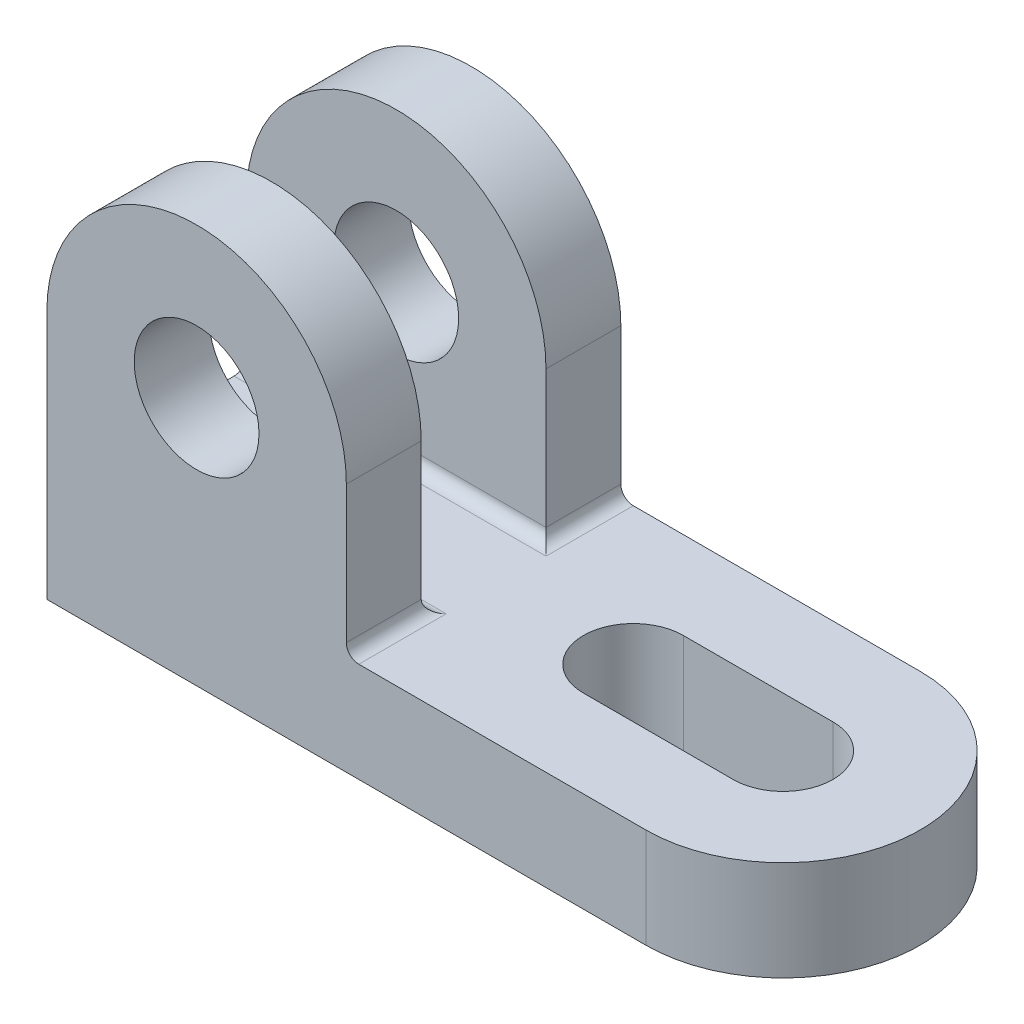
ISO-10303-21;
HEADER;
FILE_DESCRIPTION(('STEP AP214'),'2;1');
FILE_NAME('part.step','',(''),(''),'','','');
FILE_SCHEMA(('AUTOMOTIVE_DESIGN { 1 0 10303 214 1 1 1 1 }'));
ENDSEC;
DATA;
#1=APPLICATION_CONTEXT('core data for automotive mechanical design processes');
#2=APPLICATION_PROTOCOL_DEFINITION('international standard','automotive_design',2000,#1);
#3=PRODUCT_CONTEXT('',#1,'mechanical');
#4=PRODUCT('Part','Part','',(#3));
#5=PRODUCT_RELATED_PRODUCT_CATEGORY('part','',(#4));
#6=PRODUCT_DEFINITION_FORMATION('','',#4);
#7=PRODUCT_DEFINITION_CONTEXT('part definition',#1,'design');
#8=PRODUCT_DEFINITION('design','',#6,#7);
#9=PRODUCT_DEFINITION_SHAPE('','',#8);
#10=(LENGTH_UNIT() NAMED_UNIT(*) SI_UNIT(.MILLI.,.METRE.));
#11=(NAMED_UNIT(*) PLANE_ANGLE_UNIT() SI_UNIT($,.RADIAN.));
#12=(NAMED_UNIT(*) SI_UNIT($,.STERADIAN.) SOLID_ANGLE_UNIT());
#13=UNCERTAINTY_MEASURE_WITH_UNIT(LENGTH_MEASURE(1.E-05),#10,'distance_accuracy_value','');
#14=(GEOMETRIC_REPRESENTATION_CONTEXT(3) GLOBAL_UNCERTAINTY_ASSIGNED_CONTEXT((#13)) GLOBAL_UNIT_ASSIGNED_CONTEXT((#10,
#11,#12)) REPRESENTATION_CONTEXT('',''));
#15=CARTESIAN_POINT('',(0.,0.,0.));
#16=DIRECTION('',(0.,0.,1.));
#17=DIRECTION('',(1.,0.,0.));
#18=AXIS2_PLACEMENT_3D('',#15,#16,#17);
#19=CARTESIAN_POINT('',(0.,16.,0.));
#20=DIRECTION('',(0.,1.,0.));
#21=DIRECTION('',(0.,0.,1.));
#22=AXIS2_PLACEMENT_3D('',#19,#20,#21);
#23=PLANE('',#22);
#24=CARTESIAN_POINT('',(37.,16.,0.));
#25=DIRECTION('',(0.,1.,0.));
#26=DIRECTION('',(0.,0.,1.));
#27=AXIS2_PLACEMENT_3D('',#24,#25,#26);
#28=CIRCLE('',#27,8.00000000000003);
#29=CARTESIAN_POINT('',(37.,16.,8.00000000000003));
#30=VERTEX_POINT('',#29);
#31=CARTESIAN_POINT('',(37.,16.,-8.00000000000003));
#32=VERTEX_POINT('',#31);
#33=EDGE_CURVE('E209',#30,#32,#28,.T.);
#34=ORIENTED_EDGE('',*,*,#33,.F.);
#35=DIRECTION('',(1.,0.,0.));
#36=VECTOR('',#35,1.);
#37=CARTESIAN_POINT('',(37.,16.,8.00000000000003));
#38=LINE('',#37,#36);
#39=CARTESIAN_POINT('',(13.,16.,8.00000000000003));
#40=VERTEX_POINT('',#39);
#41=EDGE_CURVE('E216',#40,#30,#38,.T.);
#42=ORIENTED_EDGE('',*,*,#41,.F.);
#43=CARTESIAN_POINT('',(13.,16.,0.));
#44=DIRECTION('',(0.,1.,0.));
#45=DIRECTION('',(0.,0.,1.));
#46=AXIS2_PLACEMENT_3D('',#43,#44,#45);
#47=CIRCLE('',#46,8.00000000000003);
#48=CARTESIAN_POINT('',(13.,16.,-8.00000000000002));
#49=VERTEX_POINT('',#48);
#50=EDGE_CURVE('E230',#49,#40,#47,.T.);
#51=ORIENTED_EDGE('',*,*,#50,.F.);
#52=DIRECTION('',(-1.,0.,0.));
#53=VECTOR('',#52,1.);
#54=CARTESIAN_POINT('',(37.,16.,-8.00000000000003));
#55=LINE('',#54,#53);
#56=EDGE_CURVE('E227',#32,#49,#55,.T.);
#57=ORIENTED_EDGE('',*,*,#56,.F.);
#58=EDGE_LOOP('',(#34,#42,#51,#57));
#59=FACE_BOUND('',#58,.T.);
#60=DIRECTION('',(0.,0.,-1.));
#61=VECTOR('',#60,1.);
#62=CARTESIAN_POINT('',(-9.00000000000001,16.,0.));
#63=LINE('',#62,#61);
#64=CARTESIAN_POINT('',(-9.00000000000001,16.,-22.));
#65=VERTEX_POINT('',#64);
#66=CARTESIAN_POINT('',(-9.00000000000001,16.,-8.00000000000002));
#67=VERTEX_POINT('',#66);
#68=EDGE_CURVE('E278',#65,#67,#63,.F.);
#69=ORIENTED_EDGE('',*,*,#68,.T.);
#70=DIRECTION('',(-1.,0.,0.));
#71=VECTOR('',#70,1.);
#72=CARTESIAN_POINT('',(0.,16.,-8.00000000000002));
#73=LINE('',#72,#71);
#74=CARTESIAN_POINT('',(-59.,16.,-8.00000000000002));
#75=VERTEX_POINT('',#74);
#76=EDGE_CURVE('E280',#67,#75,#73,.T.);
#77=ORIENTED_EDGE('',*,*,#76,.T.);
#78=DIRECTION('',(0.,0.,1.));
#79=VECTOR('',#78,1.);
#80=CARTESIAN_POINT('',(-59.,16.,0.));
#81=LINE('',#80,#79);
#82=CARTESIAN_POINT('',(-59.,16.,8.00000000000002));
#83=VERTEX_POINT('',#82);
#84=EDGE_CURVE('E252',#75,#83,#81,.T.);
#85=ORIENTED_EDGE('',*,*,#84,.T.);
#86=DIRECTION('',(-1.,0.,0.));
#87=VECTOR('',#86,1.);
#88=CARTESIAN_POINT('',(0.,16.,8.00000000000002));
#89=LINE('',#88,#87);
#90=CARTESIAN_POINT('',(-9.00000000000001,16.,8.00000000000002));
#91=VERTEX_POINT('',#90);
#92=EDGE_CURVE('E276',#83,#91,#89,.F.);
#93=ORIENTED_EDGE('',*,*,#92,.T.);
#94=DIRECTION('',(0.,0.,1.));
#95=VECTOR('',#94,1.);
#96=CARTESIAN_POINT('',(-9.00000000000001,16.,22.));
#97=LINE('',#96,#95);
#98=CARTESIAN_POINT('',(-9.00000000000001,16.,22.));
#99=VERTEX_POINT('',#98);
#100=EDGE_CURVE('E274',#91,#99,#97,.T.);
#101=ORIENTED_EDGE('',*,*,#100,.T.);
#102=DIRECTION('',(1.,0.,0.));
#103=VECTOR('',#102,1.);
#104=CARTESIAN_POINT('',(0.,16.,22.));
#105=LINE('',#104,#103);
#106=CARTESIAN_POINT('',(37.,16.,22.));
#107=VERTEX_POINT('',#106);
#108=EDGE_CURVE('E244',#99,#107,#105,.T.);
#109=ORIENTED_EDGE('',*,*,#108,.T.);
#110=CARTESIAN_POINT('',(37.,16.,0.));
#111=DIRECTION('',(0.,1.,0.));
#112=DIRECTION('',(0.,0.,1.));
#113=AXIS2_PLACEMENT_3D('',#110,#111,#112);
#114=CIRCLE('',#113,22.);
#115=CARTESIAN_POINT('',(37.,16.,-22.));
#116=VERTEX_POINT('',#115);
#117=EDGE_CURVE('E246',#107,#116,#114,.T.);
#118=ORIENTED_EDGE('',*,*,#117,.T.);
#119=DIRECTION('',(1.,0.,0.));
#120=VECTOR('',#119,1.);
#121=CARTESIAN_POINT('',(0.,16.,-22.));
#122=LINE('',#121,#120);
#123=EDGE_CURVE('E250',#65,#116,#122,.T.);
#124=ORIENTED_EDGE('',*,*,#123,.F.);
#125=EDGE_LOOP('',(#69,#77,#85,#93,#101,#109,#118,#124));
#126=FACE_BOUND('',#125,.T.);
#127=ADVANCED_FACE('F39',(#59,#126),#23,.T.);
#128=CARTESIAN_POINT('',(0.,16.,22.));
#129=DIRECTION('',(0.,0.,-1.));
#130=DIRECTION('',(-1.,0.,0.));
#131=AXIS2_PLACEMENT_3D('',#128,#129,#130);
#132=PLANE('',#131);
#133=DIRECTION('',(1.,0.,0.));
#134=VECTOR('',#133,1.);
#135=CARTESIAN_POINT('',(0.,0.,22.));
#136=LINE('',#135,#134);
#137=CARTESIAN_POINT('',(-59.,0.,22.));
#138=VERTEX_POINT('',#137);
#139=CARTESIAN_POINT('',(37.,0.,22.));
#140=VERTEX_POINT('',#139);
#141=EDGE_CURVE('E237',#138,#140,#136,.T.);
#142=ORIENTED_EDGE('',*,*,#141,.T.);
#143=DIRECTION('',(0.,-1.,0.));
#144=VECTOR('',#143,1.);
#145=CARTESIAN_POINT('',(37.,16.,22.));
#146=LINE('',#145,#144);
#147=EDGE_CURVE('E271',#107,#140,#146,.T.);
#148=ORIENTED_EDGE('',*,*,#147,.F.);
#149=ORIENTED_EDGE('',*,*,#108,.F.);
#150=CARTESIAN_POINT('',(-9.00000000000001,18.,22.));
#151=DIRECTION('',(0.,0.,-1.));
#152=DIRECTION('',(-1.,0.,0.));
#153=AXIS2_PLACEMENT_3D('',#150,#151,#152);
#154=CIRCLE('',#153,2.);
#155=CARTESIAN_POINT('',(-11.,18.,22.));
#156=VERTEX_POINT('',#155);
#157=EDGE_CURVE('E11',#99,#156,#154,.T.);
#158=ORIENTED_EDGE('',*,*,#157,.T.);
#159=DIRECTION('',(0.,1.,0.));
#160=VECTOR('',#159,1.);
#161=CARTESIAN_POINT('',(-11.,0.,22.));
#162=LINE('',#161,#160);
#163=CARTESIAN_POINT('',(-11.,40.,22.));
#164=VERTEX_POINT('',#163);
#165=EDGE_CURVE('E202',#156,#164,#162,.T.);
#166=ORIENTED_EDGE('',*,*,#165,.T.);
#167=CARTESIAN_POINT('',(-35.,40.,22.));
#168=DIRECTION('',(0.,0.,1.));
#169=DIRECTION('',(1.,0.,0.));
#170=AXIS2_PLACEMENT_3D('',#167,#168,#169);
#171=CIRCLE('',#170,24.);
#172=CARTESIAN_POINT('',(-59.,40.,22.));
#173=VERTEX_POINT('',#172);
#174=EDGE_CURVE('E192',#164,#173,#171,.T.);
#175=ORIENTED_EDGE('',*,*,#174,.T.);
#176=DIRECTION('',(0.,-1.,0.));
#177=VECTOR('',#176,1.);
#178=CARTESIAN_POINT('',(-59.,16.,22.));
#179=LINE('',#178,#177);
#180=EDGE_CURVE('E255',#173,#138,#179,.T.);
#181=ORIENTED_EDGE('',*,*,#180,.T.);
#182=EDGE_LOOP('',(#142,#148,#149,#158,#166,#175,#181));
#183=FACE_BOUND('',#182,.T.);
#184=CARTESIAN_POINT('',(-35.,40.,22.));
#185=DIRECTION('',(0.,0.,1.));
#186=DIRECTION('',(1.,0.,0.));
#187=AXIS2_PLACEMENT_3D('',#184,#185,#186);
#188=CIRCLE('',#187,10.);
#189=CARTESIAN_POINT('',(-25.,40.,22.));
#190=VERTEX_POINT('',#189);
#191=EDGE_CURVE('E184',#190,#190,#188,.T.);
#192=ORIENTED_EDGE('',*,*,#191,.F.);
#193=EDGE_LOOP('',(#192));
#194=FACE_BOUND('',#193,.T.);
#195=ADVANCED_FACE('F315',(#183,#194),#132,.F.);
#196=CARTESIAN_POINT('',(37.,16.,0.));
#197=DIRECTION('',(0.,-1.,0.));
#198=DIRECTION('',(0.,0.,-1.));
#199=AXIS2_PLACEMENT_3D('',#196,#197,#198);
#200=CYLINDRICAL_SURFACE('',#199,22.);
#201=CARTESIAN_POINT('',(37.,0.,0.));
#202=DIRECTION('',(0.,1.,0.));
#203=DIRECTION('',(0.,0.,1.));
#204=AXIS2_PLACEMENT_3D('',#201,#202,#203);
#205=CIRCLE('',#204,22.);
#206=CARTESIAN_POINT('',(37.,0.,-22.));
#207=VERTEX_POINT('',#206);
#208=EDGE_CURVE('E258',#140,#207,#205,.T.);
#209=ORIENTED_EDGE('',*,*,#208,.T.);
#210=DIRECTION('',(0.,-1.,0.));
#211=VECTOR('',#210,1.);
#212=CARTESIAN_POINT('',(37.,16.,-22.));
#213=LINE('',#212,#211);
#214=EDGE_CURVE('E269',#116,#207,#213,.T.);
#215=ORIENTED_EDGE('',*,*,#214,.F.);
#216=ORIENTED_EDGE('',*,*,#117,.F.);
#217=ORIENTED_EDGE('',*,*,#147,.T.);
#218=EDGE_LOOP('',(#209,#215,#216,#217));
#219=FACE_BOUND('',#218,.T.);
#220=ADVANCED_FACE('F319',(#219),#200,.T.);
#221=CARTESIAN_POINT('',(0.,16.,-22.));
#222=DIRECTION('',(0.,0.,-1.));
#223=DIRECTION('',(-1.,0.,0.));
#224=AXIS2_PLACEMENT_3D('',#221,#222,#223);
#225=PLANE('',#224);
#226=DIRECTION('',(1.,0.,0.));
#227=VECTOR('',#226,1.);
#228=CARTESIAN_POINT('',(0.,0.,-22.));
#229=LINE('',#228,#227);
#230=CARTESIAN_POINT('',(-59.,0.,-22.));
#231=VERTEX_POINT('',#230);
#232=EDGE_CURVE('E261',#231,#207,#229,.T.);
#233=ORIENTED_EDGE('',*,*,#232,.F.);
#234=DIRECTION('',(0.,-1.,0.));
#235=VECTOR('',#234,1.);
#236=CARTESIAN_POINT('',(-59.,16.,-22.));
#237=LINE('',#236,#235);
#238=CARTESIAN_POINT('',(-59.,40.,-22.));
#239=VERTEX_POINT('',#238);
#240=EDGE_CURVE('E267',#239,#231,#237,.T.);
#241=ORIENTED_EDGE('',*,*,#240,.F.);
#242=CARTESIAN_POINT('',(-35.,40.,-22.));
#243=DIRECTION('',(0.,0.,1.));
#244=DIRECTION('',(1.,0.,0.));
#245=AXIS2_PLACEMENT_3D('',#242,#243,#244);
#246=CIRCLE('',#245,24.);
#247=CARTESIAN_POINT('',(-11.,40.,-22.));
#248=VERTEX_POINT('',#247);
#249=EDGE_CURVE('E181',#248,#239,#246,.T.);
#250=ORIENTED_EDGE('',*,*,#249,.F.);
#251=DIRECTION('',(0.,1.,0.));
#252=VECTOR('',#251,1.);
#253=CARTESIAN_POINT('',(-11.,0.,-22.));
#254=LINE('',#253,#252);
#255=CARTESIAN_POINT('',(-11.,18.,-22.));
#256=VERTEX_POINT('',#255);
#257=EDGE_CURVE('E301',#256,#248,#254,.T.);
#258=ORIENTED_EDGE('',*,*,#257,.F.);
#259=CARTESIAN_POINT('',(-9.00000000000001,18.,-22.));
#260=DIRECTION('',(0.,0.,-1.));
#261=DIRECTION('',(-1.,0.,0.));
#262=AXIS2_PLACEMENT_3D('',#259,#260,#261);
#263=CIRCLE('',#262,2.);
#264=EDGE_CURVE('E48',#256,#65,#263,.F.);
#265=ORIENTED_EDGE('',*,*,#264,.T.);
#266=ORIENTED_EDGE('',*,*,#123,.T.);
#267=ORIENTED_EDGE('',*,*,#214,.T.);
#268=EDGE_LOOP('',(#233,#241,#250,#258,#265,#266,#267));
#269=FACE_BOUND('',#268,.T.);
#270=CARTESIAN_POINT('',(-35.,40.,-22.));
#271=DIRECTION('',(0.,0.,1.));
#272=DIRECTION('',(1.,0.,0.));
#273=AXIS2_PLACEMENT_3D('',#270,#271,#272);
#274=CIRCLE('',#273,10.);
#275=CARTESIAN_POINT('',(-25.,40.,-22.));
#276=VERTEX_POINT('',#275);
#277=EDGE_CURVE('E296',#276,#276,#274,.T.);
#278=ORIENTED_EDGE('',*,*,#277,.T.);
#279=EDGE_LOOP('',(#278));
#280=FACE_BOUND('',#279,.T.);
#281=ADVANCED_FACE('F344',(#269,#280),#225,.T.);
#282=CARTESIAN_POINT('',(-59.,16.,0.));
#283=DIRECTION('',(1.,0.,0.));
#284=DIRECTION('',(0.,0.,-1.));
#285=AXIS2_PLACEMENT_3D('',#282,#283,#284);
#286=PLANE('',#285);
#287=DIRECTION('',(0.,0.,1.));
#288=VECTOR('',#287,1.);
#289=CARTESIAN_POINT('',(-59.,0.,0.));
#290=LINE('',#289,#288);
#291=EDGE_CURVE('E247',#231,#138,#290,.T.);
#292=ORIENTED_EDGE('',*,*,#291,.T.);
#293=ORIENTED_EDGE('',*,*,#180,.F.);
#294=DIRECTION('',(0.,0.,1.));
#295=VECTOR('',#294,1.);
#296=CARTESIAN_POINT('',(-59.,40.,10.));
#297=LINE('',#296,#295);
#298=CARTESIAN_POINT('',(-59.,40.,10.));
#299=VERTEX_POINT('',#298);
#300=EDGE_CURVE('E206',#299,#173,#297,.T.);
#301=ORIENTED_EDGE('',*,*,#300,.F.);
#302=DIRECTION('',(0.,1.,0.));
#303=VECTOR('',#302,1.);
#304=CARTESIAN_POINT('',(-59.,0.,10.));
#305=LINE('',#304,#303);
#306=CARTESIAN_POINT('',(-59.,18.,10.));
#307=VERTEX_POINT('',#306);
#308=EDGE_CURVE('E197',#307,#299,#305,.T.);
#309=ORIENTED_EDGE('',*,*,#308,.F.);
#310=CARTESIAN_POINT('',(-59.,18.,8.00000000000002));
#311=DIRECTION('',(1.,0.,0.));
#312=DIRECTION('',(0.,0.,-1.));
#313=AXIS2_PLACEMENT_3D('',#310,#311,#312);
#314=CIRCLE('',#313,2.);
#315=EDGE_CURVE('E292',#307,#83,#314,.T.);
#316=ORIENTED_EDGE('',*,*,#315,.T.);
#317=ORIENTED_EDGE('',*,*,#84,.F.);
#318=CARTESIAN_POINT('',(-59.,18.,-8.00000000000002));
#319=DIRECTION('',(1.,0.,0.));
#320=DIRECTION('',(0.,0.,-1.));
#321=AXIS2_PLACEMENT_3D('',#318,#319,#320);
#322=CIRCLE('',#321,2.);
#323=CARTESIAN_POINT('',(-59.,18.,-10.));
#324=VERTEX_POINT('',#323);
#325=EDGE_CURVE('E167',#75,#324,#322,.T.);
#326=ORIENTED_EDGE('',*,*,#325,.T.);
#327=DIRECTION('',(0.,1.,0.));
#328=VECTOR('',#327,1.);
#329=CARTESIAN_POINT('',(-59.,0.,-10.));
#330=LINE('',#329,#328);
#331=CARTESIAN_POINT('',(-59.,40.,-10.));
#332=VERTEX_POINT('',#331);
#333=EDGE_CURVE('E160',#324,#332,#330,.T.);
#334=ORIENTED_EDGE('',*,*,#333,.T.);
#335=DIRECTION('',(0.,0.,-1.));
#336=VECTOR('',#335,1.);
#337=CARTESIAN_POINT('',(-59.,40.,-10.));
#338=LINE('',#337,#336);
#339=EDGE_CURVE('E164',#332,#239,#338,.T.);
#340=ORIENTED_EDGE('',*,*,#339,.T.);
#341=ORIENTED_EDGE('',*,*,#240,.T.);
#342=EDGE_LOOP('',(#292,#293,#301,#309,#316,#317,#326,#334,#340,#341));
#343=FACE_BOUND('',#342,.T.);
#344=ADVANCED_FACE('F162',(#343),#286,.F.);
#345=CARTESIAN_POINT('',(0.,0.,0.));
#346=DIRECTION('',(0.,1.,0.));
#347=DIRECTION('',(0.,0.,1.));
#348=AXIS2_PLACEMENT_3D('',#345,#346,#347);
#349=PLANE('',#348);
#350=DIRECTION('',(1.,0.,0.));
#351=VECTOR('',#350,1.);
#352=CARTESIAN_POINT('',(37.,0.,8.00000000000003));
#353=LINE('',#352,#351);
#354=CARTESIAN_POINT('',(13.,0.,8.00000000000003));
#355=VERTEX_POINT('',#354);
#356=CARTESIAN_POINT('',(37.,0.,8.00000000000003));
#357=VERTEX_POINT('',#356);
#358=EDGE_CURVE('E222',#355,#357,#353,.T.);
#359=ORIENTED_EDGE('',*,*,#358,.T.);
#360=CARTESIAN_POINT('',(37.,0.,0.));
#361=DIRECTION('',(0.,1.,0.));
#362=DIRECTION('',(0.,0.,1.));
#363=AXIS2_PLACEMENT_3D('',#360,#361,#362);
#364=CIRCLE('',#363,8.00000000000003);
#365=CARTESIAN_POINT('',(37.,0.,-8.00000000000003));
#366=VERTEX_POINT('',#365);
#367=EDGE_CURVE('E212',#357,#366,#364,.T.);
#368=ORIENTED_EDGE('',*,*,#367,.T.);
#369=DIRECTION('',(-1.,0.,0.));
#370=VECTOR('',#369,1.);
#371=CARTESIAN_POINT('',(37.,0.,-8.00000000000003));
#372=LINE('',#371,#370);
#373=CARTESIAN_POINT('',(13.,0.,-8.00000000000002));
#374=VERTEX_POINT('',#373);
#375=EDGE_CURVE('E215',#366,#374,#372,.T.);
#376=ORIENTED_EDGE('',*,*,#375,.T.);
#377=CARTESIAN_POINT('',(13.,0.,0.));
#378=DIRECTION('',(0.,1.,0.));
#379=DIRECTION('',(0.,0.,1.));
#380=AXIS2_PLACEMENT_3D('',#377,#378,#379);
#381=CIRCLE('',#380,8.00000000000003);
#382=EDGE_CURVE('E219',#374,#355,#381,.T.);
#383=ORIENTED_EDGE('',*,*,#382,.T.);
#384=EDGE_LOOP('',(#359,#368,#376,#383));
#385=FACE_BOUND('',#384,.T.);
#386=ORIENTED_EDGE('',*,*,#141,.F.);
#387=ORIENTED_EDGE('',*,*,#291,.F.);
#388=ORIENTED_EDGE('',*,*,#232,.T.);
#389=ORIENTED_EDGE('',*,*,#208,.F.);
#390=EDGE_LOOP('',(#386,#387,#388,#389));
#391=FACE_BOUND('',#390,.T.);
#392=ADVANCED_FACE('F342',(#385,#391),#349,.F.);
#393=CARTESIAN_POINT('',(37.,0.,0.));
#394=DIRECTION('',(0.,1.,0.));
#395=DIRECTION('',(0.,0.,1.));
#396=AXIS2_PLACEMENT_3D('',#393,#394,#395);
#397=CYLINDRICAL_SURFACE('',#396,8.00000000000003);
#398=ORIENTED_EDGE('',*,*,#33,.T.);
#399=DIRECTION('',(0.,1.,0.));
#400=VECTOR('',#399,1.);
#401=CARTESIAN_POINT('',(37.,0.,-8.00000000000003));
#402=LINE('',#401,#400);
#403=EDGE_CURVE('E225',#366,#32,#402,.T.);
#404=ORIENTED_EDGE('',*,*,#403,.F.);
#405=ORIENTED_EDGE('',*,*,#367,.F.);
#406=DIRECTION('',(0.,1.,0.));
#407=VECTOR('',#406,1.);
#408=CARTESIAN_POINT('',(37.,0.,8.00000000000003));
#409=LINE('',#408,#407);
#410=EDGE_CURVE('E235',#357,#30,#409,.T.);
#411=ORIENTED_EDGE('',*,*,#410,.T.);
#412=EDGE_LOOP('',(#398,#404,#405,#411));
#413=FACE_BOUND('',#412,.T.);
#414=ADVANCED_FACE('F377',(#413),#397,.F.);
#415=CARTESIAN_POINT('',(37.,0.,8.00000000000003));
#416=DIRECTION('',(0.,0.,1.));
#417=DIRECTION('',(1.,0.,0.));
#418=AXIS2_PLACEMENT_3D('',#415,#416,#417);
#419=PLANE('',#418);
#420=ORIENTED_EDGE('',*,*,#41,.T.);
#421=ORIENTED_EDGE('',*,*,#410,.F.);
#422=ORIENTED_EDGE('',*,*,#358,.F.);
#423=DIRECTION('',(0.,1.,0.));
#424=VECTOR('',#423,1.);
#425=CARTESIAN_POINT('',(13.,0.,8.00000000000003));
#426=LINE('',#425,#424);
#427=EDGE_CURVE('E238',#355,#40,#426,.T.);
#428=ORIENTED_EDGE('',*,*,#427,.T.);
#429=EDGE_LOOP('',(#420,#421,#422,#428));
#430=FACE_BOUND('',#429,.T.);
#431=ADVANCED_FACE('F498',(#430),#419,.F.);
#432=CARTESIAN_POINT('',(13.,0.,0.));
#433=DIRECTION('',(0.,1.,0.));
#434=DIRECTION('',(0.,0.,1.));
#435=AXIS2_PLACEMENT_3D('',#432,#433,#434);
#436=CYLINDRICAL_SURFACE('',#435,8.00000000000003);
#437=ORIENTED_EDGE('',*,*,#50,.T.);
#438=ORIENTED_EDGE('',*,*,#427,.F.);
#439=ORIENTED_EDGE('',*,*,#382,.F.);
#440=DIRECTION('',(0.,1.,0.));
#441=VECTOR('',#440,1.);
#442=CARTESIAN_POINT('',(13.,0.,-8.00000000000002));
#443=LINE('',#442,#441);
#444=EDGE_CURVE('E240',#374,#49,#443,.T.);
#445=ORIENTED_EDGE('',*,*,#444,.T.);
#446=EDGE_LOOP('',(#437,#438,#439,#445));
#447=FACE_BOUND('',#446,.T.);
#448=ADVANCED_FACE('F487',(#447),#436,.F.);
#449=CARTESIAN_POINT('',(37.,0.,-8.00000000000003));
#450=DIRECTION('',(0.,0.,-1.));
#451=DIRECTION('',(-1.,0.,0.));
#452=AXIS2_PLACEMENT_3D('',#449,#450,#451);
#453=PLANE('',#452);
#454=ORIENTED_EDGE('',*,*,#56,.T.);
#455=ORIENTED_EDGE('',*,*,#444,.F.);
#456=ORIENTED_EDGE('',*,*,#375,.F.);
#457=ORIENTED_EDGE('',*,*,#403,.T.);
#458=EDGE_LOOP('',(#454,#455,#456,#457));
#459=FACE_BOUND('',#458,.T.);
#460=ADVANCED_FACE('F481',(#459),#453,.F.);
#461=CARTESIAN_POINT('',(-11.,0.,10.));
#462=DIRECTION('',(1.,0.,0.));
#463=DIRECTION('',(0.,1.,0.));
#464=AXIS2_PLACEMENT_3D('',#461,#462,#463);
#465=PLANE('',#464);
#466=ORIENTED_EDGE('',*,*,#165,.F.);
#467=DIRECTION('',(0.,0.,1.));
#468=VECTOR('',#467,1.);
#469=CARTESIAN_POINT('',(-11.,18.,10.));
#470=LINE('',#469,#468);
#471=CARTESIAN_POINT('',(-11.,18.,10.));
#472=VERTEX_POINT('',#471);
#473=EDGE_CURVE('E289',#156,#472,#470,.F.);
#474=ORIENTED_EDGE('',*,*,#473,.T.);
#475=DIRECTION('',(0.,1.,0.));
#476=VECTOR('',#475,1.);
#477=CARTESIAN_POINT('',(-11.,0.,10.));
#478=LINE('',#477,#476);
#479=CARTESIAN_POINT('',(-11.,40.,10.));
#480=VERTEX_POINT('',#479);
#481=EDGE_CURVE('E191',#472,#480,#478,.T.);
#482=ORIENTED_EDGE('',*,*,#481,.T.);
#483=DIRECTION('',(0.,0.,1.));
#484=VECTOR('',#483,1.);
#485=CARTESIAN_POINT('',(-11.,40.,10.));
#486=LINE('',#485,#484);
#487=EDGE_CURVE('E199',#480,#164,#486,.T.);
#488=ORIENTED_EDGE('',*,*,#487,.T.);
#489=EDGE_LOOP('',(#466,#474,#482,#488));
#490=FACE_BOUND('',#489,.T.);
#491=ADVANCED_FACE('F336',(#490),#465,.T.);
#492=CARTESIAN_POINT('',(-35.,40.,10.));
#493=DIRECTION('',(0.,0.,1.));
#494=DIRECTION('',(1.,0.,0.));
#495=AXIS2_PLACEMENT_3D('',#492,#493,#494);
#496=CYLINDRICAL_SURFACE('',#495,10.);
#497=CARTESIAN_POINT('',(-35.,40.,10.));
#498=DIRECTION('',(0.,0.,1.));
#499=DIRECTION('',(1.,0.,0.));
#500=AXIS2_PLACEMENT_3D('',#497,#498,#499);
#501=CIRCLE('',#500,10.);
#502=CARTESIAN_POINT('',(-25.,40.,10.));
#503=VERTEX_POINT('',#502);
#504=EDGE_CURVE('E188',#503,#503,#501,.T.);
#505=ORIENTED_EDGE('',*,*,#504,.F.);
#506=EDGE_LOOP('',(#505));
#507=FACE_BOUND('',#506,.T.);
#508=ORIENTED_EDGE('',*,*,#191,.T.);
#509=EDGE_LOOP('',(#508));
#510=FACE_BOUND('',#509,.T.);
#511=ADVANCED_FACE('F567',(#507,#510),#496,.F.);
#512=CARTESIAN_POINT('',(-35.,40.,10.));
#513=DIRECTION('',(0.,0.,1.));
#514=DIRECTION('',(1.,0.,0.));
#515=AXIS2_PLACEMENT_3D('',#512,#513,#514);
#516=CYLINDRICAL_SURFACE('',#515,24.);
#517=ORIENTED_EDGE('',*,*,#174,.F.);
#518=ORIENTED_EDGE('',*,*,#487,.F.);
#519=CARTESIAN_POINT('',(-35.,40.,10.));
#520=DIRECTION('',(0.,0.,1.));
#521=DIRECTION('',(1.,0.,0.));
#522=AXIS2_PLACEMENT_3D('',#519,#520,#521);
#523=CIRCLE('',#522,24.);
#524=EDGE_CURVE('E194',#480,#299,#523,.T.);
#525=ORIENTED_EDGE('',*,*,#524,.T.);
#526=ORIENTED_EDGE('',*,*,#300,.T.);
#527=EDGE_LOOP('',(#517,#518,#525,#526));
#528=FACE_BOUND('',#527,.T.);
#529=ADVANCED_FACE('F339',(#528),#516,.T.);
#530=CARTESIAN_POINT('',(0.,0.,10.));
#531=DIRECTION('',(0.,0.,1.));
#532=DIRECTION('',(1.,0.,0.));
#533=AXIS2_PLACEMENT_3D('',#530,#531,#532);
#534=PLANE('',#533);
#535=ORIENTED_EDGE('',*,*,#504,.T.);
#536=EDGE_LOOP('',(#535));
#537=FACE_BOUND('',#536,.T.);
#538=ORIENTED_EDGE('',*,*,#481,.F.);
#539=DIRECTION('',(-1.,0.,0.));
#540=VECTOR('',#539,1.);
#541=CARTESIAN_POINT('',(0.,18.,10.));
#542=LINE('',#541,#540);
#543=EDGE_CURVE('E285',#472,#307,#542,.T.);
#544=ORIENTED_EDGE('',*,*,#543,.T.);
#545=ORIENTED_EDGE('',*,*,#308,.T.);
#546=ORIENTED_EDGE('',*,*,#524,.F.);
#547=EDGE_LOOP('',(#538,#544,#545,#546));
#548=FACE_BOUND('',#547,.T.);
#549=ADVANCED_FACE('F332',(#537,#548),#534,.F.);
#550=CARTESIAN_POINT('',(-11.,0.,-10.));
#551=DIRECTION('',(-1.,0.,0.));
#552=DIRECTION('',(0.,-1.,0.));
#553=AXIS2_PLACEMENT_3D('',#550,#551,#552);
#554=PLANE('',#553);
#555=DIRECTION('',(0.,1.,0.));
#556=VECTOR('',#555,1.);
#557=CARTESIAN_POINT('',(-11.,0.,-10.));
#558=LINE('',#557,#556);
#559=CARTESIAN_POINT('',(-11.,18.,-10.));
#560=VERTEX_POINT('',#559);
#561=CARTESIAN_POINT('',(-11.,40.,-10.));
#562=VERTEX_POINT('',#561);
#563=EDGE_CURVE('E171',#560,#562,#558,.T.);
#564=ORIENTED_EDGE('',*,*,#563,.F.);
#565=DIRECTION('',(0.,0.,-1.));
#566=VECTOR('',#565,1.);
#567=CARTESIAN_POINT('',(-11.,18.,-10.));
#568=LINE('',#567,#566);
#569=EDGE_CURVE('E62',#560,#256,#568,.T.);
#570=ORIENTED_EDGE('',*,*,#569,.T.);
#571=ORIENTED_EDGE('',*,*,#257,.T.);
#572=DIRECTION('',(0.,0.,-1.));
#573=VECTOR('',#572,1.);
#574=CARTESIAN_POINT('',(-11.,40.,-10.));
#575=LINE('',#574,#573);
#576=EDGE_CURVE('E182',#562,#248,#575,.T.);
#577=ORIENTED_EDGE('',*,*,#576,.F.);
#578=EDGE_LOOP('',(#564,#570,#571,#577));
#579=FACE_BOUND('',#578,.T.);
#580=ADVANCED_FACE('F347',(#579),#554,.F.);
#581=CARTESIAN_POINT('',(-35.,40.,-10.));
#582=DIRECTION('',(0.,0.,-1.));
#583=DIRECTION('',(-1.,0.,0.));
#584=AXIS2_PLACEMENT_3D('',#581,#582,#583);
#585=CYLINDRICAL_SURFACE('',#584,24.);
#586=ORIENTED_EDGE('',*,*,#249,.T.);
#587=ORIENTED_EDGE('',*,*,#339,.F.);
#588=CARTESIAN_POINT('',(-35.,40.,-10.));
#589=DIRECTION('',(0.,0.,1.));
#590=DIRECTION('',(1.,0.,0.));
#591=AXIS2_PLACEMENT_3D('',#588,#589,#590);
#592=CIRCLE('',#591,24.);
#593=EDGE_CURVE('E170',#562,#332,#592,.T.);
#594=ORIENTED_EDGE('',*,*,#593,.F.);
#595=ORIENTED_EDGE('',*,*,#576,.T.);
#596=EDGE_LOOP('',(#586,#587,#594,#595));
#597=FACE_BOUND('',#596,.T.);
#598=ADVANCED_FACE('F179',(#597),#585,.T.);
#599=CARTESIAN_POINT('',(-35.,40.,-10.));
#600=DIRECTION('',(0.,0.,-1.));
#601=DIRECTION('',(-1.,0.,0.));
#602=AXIS2_PLACEMENT_3D('',#599,#600,#601);
#603=CYLINDRICAL_SURFACE('',#602,10.);
#604=CARTESIAN_POINT('',(-35.,40.,-10.));
#605=DIRECTION('',(0.,0.,1.));
#606=DIRECTION('',(1.,0.,0.));
#607=AXIS2_PLACEMENT_3D('',#604,#605,#606);
#608=CIRCLE('',#607,10.);
#609=CARTESIAN_POINT('',(-25.,40.,-10.));
#610=VERTEX_POINT('',#609);
#611=EDGE_CURVE('E346',#610,#610,#608,.T.);
#612=ORIENTED_EDGE('',*,*,#611,.T.);
#613=EDGE_LOOP('',(#612));
#614=FACE_BOUND('',#613,.T.);
#615=ORIENTED_EDGE('',*,*,#277,.F.);
#616=EDGE_LOOP('',(#615));
#617=FACE_BOUND('',#616,.T.);
#618=ADVANCED_FACE('F354',(#614,#617),#603,.F.);
#619=CARTESIAN_POINT('',(0.,0.,-10.));
#620=DIRECTION('',(0.,0.,-1.));
#621=DIRECTION('',(1.,0.,0.));
#622=AXIS2_PLACEMENT_3D('',#619,#620,#621);
#623=PLANE('',#622);
#624=ORIENTED_EDGE('',*,*,#611,.F.);
#625=EDGE_LOOP('',(#624));
#626=FACE_BOUND('',#625,.T.);
#627=ORIENTED_EDGE('',*,*,#333,.F.);
#628=DIRECTION('',(-1.,0.,0.));
#629=VECTOR('',#628,1.);
#630=CARTESIAN_POINT('',(0.,18.,-10.));
#631=LINE('',#630,#629);
#632=EDGE_CURVE('E283',#324,#560,#631,.F.);
#633=ORIENTED_EDGE('',*,*,#632,.T.);
#634=ORIENTED_EDGE('',*,*,#563,.T.);
#635=ORIENTED_EDGE('',*,*,#593,.T.);
#636=EDGE_LOOP('',(#627,#633,#634,#635));
#637=FACE_BOUND('',#636,.T.);
#638=ADVANCED_FACE('F174',(#626,#637),#623,.F.);
#639=CARTESIAN_POINT('',(-9.00000000000001,18.,-10.));
#640=DIRECTION('',(0.,0.,-1.));
#641=DIRECTION('',(-1.,0.,0.));
#642=AXIS2_PLACEMENT_3D('',#639,#640,#641);
#643=CYLINDRICAL_SURFACE('',#642,2.);
#644=ORIENTED_EDGE('',*,*,#264,.F.);
#645=ORIENTED_EDGE('',*,*,#569,.F.);
#646=CARTESIAN_POINT('',(-9.00000000000001,18.,-8.00000000000002));
#647=DIRECTION('',(0.707106781186547,0.,-0.707106781186547));
#648=DIRECTION('',(-0.707106781186547,0.,-0.707106781186547));
#649=AXIS2_PLACEMENT_3D('',#646,#647,#648);
#650=ELLIPSE('',#649,2.82842712474619,2.);
#651=EDGE_CURVE('E294',#67,#560,#650,.T.);
#652=ORIENTED_EDGE('',*,*,#651,.F.);
#653=ORIENTED_EDGE('',*,*,#68,.F.);
#654=EDGE_LOOP('',(#644,#645,#652,#653));
#655=FACE_BOUND('',#654,.T.);
#656=ADVANCED_FACE('F326',(#655),#643,.F.);
#657=CARTESIAN_POINT('',(0.,18.,-8.00000000000002));
#658=DIRECTION('',(-1.,0.,0.));
#659=DIRECTION('',(0.,0.,1.));
#660=AXIS2_PLACEMENT_3D('',#657,#658,#659);
#661=CYLINDRICAL_SURFACE('',#660,2.);
#662=ORIENTED_EDGE('',*,*,#651,.T.);
#663=ORIENTED_EDGE('',*,*,#632,.F.);
#664=ORIENTED_EDGE('',*,*,#325,.F.);
#665=ORIENTED_EDGE('',*,*,#76,.F.);
#666=EDGE_LOOP('',(#662,#663,#664,#665));
#667=FACE_BOUND('',#666,.T.);
#668=ADVANCED_FACE('F327',(#667),#661,.F.);
#669=CARTESIAN_POINT('',(-9.00000000000001,18.,0.));
#670=DIRECTION('',(0.,0.,-1.));
#671=DIRECTION('',(-1.,0.,0.));
#672=AXIS2_PLACEMENT_3D('',#669,#670,#671);
#673=CYLINDRICAL_SURFACE('',#672,2.);
#674=ORIENTED_EDGE('',*,*,#157,.F.);
#675=ORIENTED_EDGE('',*,*,#100,.F.);
#676=CARTESIAN_POINT('',(-9.00000000000001,18.,8.00000000000002));
#677=DIRECTION('',(-0.707106781186547,0.,-0.707106781186547));
#678=DIRECTION('',(0.707106781186547,0.,-0.707106781186547));
#679=AXIS2_PLACEMENT_3D('',#676,#677,#678);
#680=ELLIPSE('',#679,2.82842712474619,2.);
#681=EDGE_CURVE('E43',#472,#91,#680,.F.);
#682=ORIENTED_EDGE('',*,*,#681,.F.);
#683=ORIENTED_EDGE('',*,*,#473,.F.);
#684=EDGE_LOOP('',(#674,#675,#682,#683));
#685=FACE_BOUND('',#684,.T.);
#686=ADVANCED_FACE('F41',(#685),#673,.F.);
#687=CARTESIAN_POINT('',(0.,18.,8.00000000000002));
#688=DIRECTION('',(-1.,0.,0.));
#689=DIRECTION('',(0.,0.,1.));
#690=AXIS2_PLACEMENT_3D('',#687,#688,#689);
#691=CYLINDRICAL_SURFACE('',#690,2.);
#692=ORIENTED_EDGE('',*,*,#681,.T.);
#693=ORIENTED_EDGE('',*,*,#92,.F.);
#694=ORIENTED_EDGE('',*,*,#315,.F.);
#695=ORIENTED_EDGE('',*,*,#543,.F.);
#696=EDGE_LOOP('',(#692,#693,#694,#695));
#697=FACE_BOUND('',#696,.T.);
#698=ADVANCED_FACE('F308',(#697),#691,.F.);
#699=CLOSED_SHELL('',(#127,#195,#220,#281,#344,#392,#414,#431,#448,#460,#491,#511,#529,#549,
#580,#598,#618,#638,#656,#668,#686,#698));
#700=MANIFOLD_SOLID_BREP('B2',#699);
#701=ADVANCED_BREP_SHAPE_REPRESENTATION('',(#18,#700),#14);
#702=SHAPE_DEFINITION_REPRESENTATION(#9,#701);
ENDSEC;
END-ISO-10303-21;
